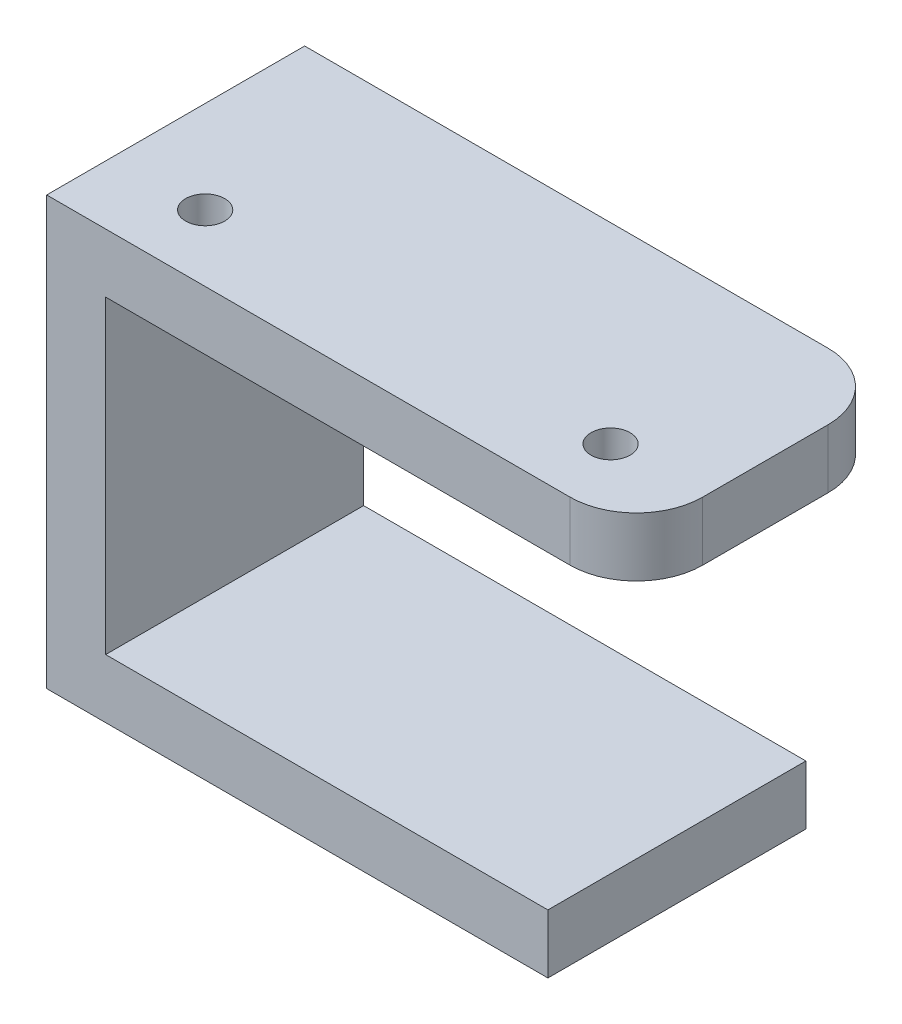
ISO-10303-21;
HEADER;
FILE_DESCRIPTION(('STEP AP214'),'2;1');
FILE_NAME('part.step','',(''),(''),'','','');
FILE_SCHEMA(('AUTOMOTIVE_DESIGN { 1 0 10303 214 1 1 1 1 }'));
ENDSEC;
DATA;
#1=APPLICATION_CONTEXT('core data for automotive mechanical design processes');
#2=APPLICATION_PROTOCOL_DEFINITION('international standard','automotive_design',2000,#1);
#3=PRODUCT_CONTEXT('',#1,'mechanical');
#4=PRODUCT('Part','Part','',(#3));
#5=PRODUCT_RELATED_PRODUCT_CATEGORY('part','',(#4));
#6=PRODUCT_DEFINITION_FORMATION('','',#4);
#7=PRODUCT_DEFINITION_CONTEXT('part definition',#1,'design');
#8=PRODUCT_DEFINITION('design','',#6,#7);
#9=PRODUCT_DEFINITION_SHAPE('','',#8);
#10=(LENGTH_UNIT() NAMED_UNIT(*) SI_UNIT(.MILLI.,.METRE.));
#11=(NAMED_UNIT(*) PLANE_ANGLE_UNIT() SI_UNIT($,.RADIAN.));
#12=(NAMED_UNIT(*) SI_UNIT($,.STERADIAN.) SOLID_ANGLE_UNIT());
#13=UNCERTAINTY_MEASURE_WITH_UNIT(LENGTH_MEASURE(1.E-05),#10,'distance_accuracy_value','');
#14=(GEOMETRIC_REPRESENTATION_CONTEXT(3) GLOBAL_UNCERTAINTY_ASSIGNED_CONTEXT((#13)) GLOBAL_UNIT_ASSIGNED_CONTEXT((#10,
#11,#12)) REPRESENTATION_CONTEXT('',''));
#15=CARTESIAN_POINT('',(0.,0.,0.));
#16=DIRECTION('',(0.,0.,1.));
#17=DIRECTION('',(1.,0.,0.));
#18=AXIS2_PLACEMENT_3D('',#15,#16,#17);
#19=CARTESIAN_POINT('',(8.,-50.,0.));
#20=DIRECTION('',(-1.,0.,0.));
#21=DIRECTION('',(0.,0.,1.));
#22=AXIS2_PLACEMENT_3D('',#19,#20,#21);
#23=PLANE('',#22);
#24=DIRECTION('',(0.,0.,1.));
#25=VECTOR('',#24,1.);
#26=CARTESIAN_POINT('',(8.,-42.,0.));
#27=LINE('',#26,#25);
#28=CARTESIAN_POINT('',(7.99999999999999,-42.,-35.));
#29=VERTEX_POINT('',#28);
#30=CARTESIAN_POINT('',(8.,-42.,0.));
#31=VERTEX_POINT('',#30);
#32=EDGE_CURVE('E198',#29,#31,#27,.T.);
#33=ORIENTED_EDGE('',*,*,#32,.F.);
#34=DIRECTION('',(0.,1.,0.));
#35=VECTOR('',#34,1.);
#36=CARTESIAN_POINT('',(7.99999999999999,-50.,-35.));
#37=LINE('',#36,#35);
#38=CARTESIAN_POINT('',(7.99999999999999,0.,-35.));
#39=VERTEX_POINT('',#38);
#40=EDGE_CURVE('E54',#29,#39,#37,.T.);
#41=ORIENTED_EDGE('',*,*,#40,.T.);
#42=DIRECTION('',(0.,0.,1.));
#43=VECTOR('',#42,1.);
#44=CARTESIAN_POINT('',(8.,0.,0.));
#45=LINE('',#44,#43);
#46=CARTESIAN_POINT('',(8.,0.,0.));
#47=VERTEX_POINT('',#46);
#48=EDGE_CURVE('E151',#39,#47,#45,.T.);
#49=ORIENTED_EDGE('',*,*,#48,.T.);
#50=DIRECTION('',(0.,1.,0.));
#51=VECTOR('',#50,1.);
#52=CARTESIAN_POINT('',(8.,-50.,0.));
#53=LINE('',#52,#51);
#54=EDGE_CURVE('E181',#31,#47,#53,.T.);
#55=ORIENTED_EDGE('',*,*,#54,.F.);
#56=EDGE_LOOP('',(#33,#41,#49,#55));
#57=FACE_BOUND('',#56,.T.);
#58=ADVANCED_FACE('F39',(#57),#23,.F.);
#59=CARTESIAN_POINT('',(71.,8.,-26.));
#60=DIRECTION('',(0.,-1.,0.));
#61=DIRECTION('',(0.,0.,-1.));
#62=AXIS2_PLACEMENT_3D('',#59,#60,#61);
#63=PLANE('',#62);
#64=DIRECTION('',(0.,0.,1.));
#65=VECTOR('',#64,1.);
#66=CARTESIAN_POINT('',(0.,8.,0.));
#67=LINE('',#66,#65);
#68=CARTESIAN_POINT('',(0.,8.,-35.));
#69=VERTEX_POINT('',#68);
#70=CARTESIAN_POINT('',(0.,8.,0.));
#71=VERTEX_POINT('',#70);
#72=EDGE_CURVE('E138',#69,#71,#67,.T.);
#73=ORIENTED_EDGE('',*,*,#72,.T.);
#74=DIRECTION('',(1.,0.,0.));
#75=VECTOR('',#74,1.);
#76=CARTESIAN_POINT('',(0.,8.,0.));
#77=LINE('',#76,#75);
#78=CARTESIAN_POINT('',(70.9999999999999,8.,0.));
#79=VERTEX_POINT('',#78);
#80=EDGE_CURVE('E93',#71,#79,#77,.T.);
#81=ORIENTED_EDGE('',*,*,#80,.T.);
#82=CARTESIAN_POINT('',(71.,8.,-9.));
#83=DIRECTION('',(0.,1.,0.));
#84=DIRECTION('',(0.,0.,1.));
#85=AXIS2_PLACEMENT_3D('',#82,#83,#84);
#86=CIRCLE('',#85,9.);
#87=CARTESIAN_POINT('',(80.,8.,-9.00000000000006));
#88=VERTEX_POINT('',#87);
#89=EDGE_CURVE('E110',#79,#88,#86,.T.);
#90=ORIENTED_EDGE('',*,*,#89,.T.);
#91=DIRECTION('',(0.,0.,-1.));
#92=VECTOR('',#91,1.);
#93=CARTESIAN_POINT('',(80.,8.,-9.00000000000006));
#94=LINE('',#93,#92);
#95=CARTESIAN_POINT('',(80.,8.,-25.9999999999999));
#96=VERTEX_POINT('',#95);
#97=EDGE_CURVE('E103',#88,#96,#94,.T.);
#98=ORIENTED_EDGE('',*,*,#97,.T.);
#99=CARTESIAN_POINT('',(71.,8.,-26.));
#100=DIRECTION('',(0.,1.,0.));
#101=DIRECTION('',(0.,0.,-1.));
#102=AXIS2_PLACEMENT_3D('',#99,#100,#101);
#103=CIRCLE('',#102,9.);
#104=CARTESIAN_POINT('',(70.9999999999999,8.,-35.));
#105=VERTEX_POINT('',#104);
#106=EDGE_CURVE('E108',#96,#105,#103,.T.);
#107=ORIENTED_EDGE('',*,*,#106,.T.);
#108=DIRECTION('',(-1.,0.,0.));
#109=VECTOR('',#108,1.);
#110=CARTESIAN_POINT('',(0.,8.,-35.));
#111=LINE('',#110,#109);
#112=EDGE_CURVE('E63',#105,#69,#111,.T.);
#113=ORIENTED_EDGE('',*,*,#112,.T.);
#114=EDGE_LOOP('',(#73,#81,#90,#98,#107,#113));
#115=FACE_BOUND('',#114,.T.);
#116=CARTESIAN_POINT('',(12.5,8.,-9.));
#117=DIRECTION('',(0.,1.,0.));
#118=DIRECTION('',(0.,0.,1.));
#119=AXIS2_PLACEMENT_3D('',#116,#117,#118);
#120=CIRCLE('',#119,2.65);
#121=CARTESIAN_POINT('',(12.5,8.,-6.35));
#122=VERTEX_POINT('',#121);
#123=EDGE_CURVE('E131',#122,#122,#120,.T.);
#124=ORIENTED_EDGE('',*,*,#123,.F.);
#125=EDGE_LOOP('',(#124));
#126=FACE_BOUND('',#125,.T.);
#127=CARTESIAN_POINT('',(67.5,8.,-9.));
#128=DIRECTION('',(0.,1.,0.));
#129=DIRECTION('',(0.,0.,1.));
#130=AXIS2_PLACEMENT_3D('',#127,#128,#129);
#131=CIRCLE('',#130,2.65);
#132=CARTESIAN_POINT('',(67.5,8.,-6.35));
#133=VERTEX_POINT('',#132);
#134=EDGE_CURVE('E172',#133,#133,#131,.T.);
#135=ORIENTED_EDGE('',*,*,#134,.F.);
#136=EDGE_LOOP('',(#135));
#137=FACE_BOUND('',#136,.T.);
#138=ADVANCED_FACE('F105',(#115,#126,#137),#63,.F.);
#139=CARTESIAN_POINT('',(71.,0.,-26.));
#140=DIRECTION('',(0.,-1.,0.));
#141=DIRECTION('',(0.,0.,-1.));
#142=AXIS2_PLACEMENT_3D('',#139,#140,#141);
#143=PLANE('',#142);
#144=ORIENTED_EDGE('',*,*,#48,.F.);
#145=DIRECTION('',(-1.,0.,0.));
#146=VECTOR('',#145,1.);
#147=CARTESIAN_POINT('',(0.,0.,-35.));
#148=LINE('',#147,#146);
#149=CARTESIAN_POINT('',(70.9999999999999,0.,-35.));
#150=VERTEX_POINT('',#149);
#151=EDGE_CURVE('E135',#150,#39,#148,.T.);
#152=ORIENTED_EDGE('',*,*,#151,.F.);
#153=CARTESIAN_POINT('',(71.,0.,-26.));
#154=DIRECTION('',(0.,1.,0.));
#155=DIRECTION('',(0.,0.,-1.));
#156=AXIS2_PLACEMENT_3D('',#153,#154,#155);
#157=CIRCLE('',#156,9.);
#158=CARTESIAN_POINT('',(80.,0.,-25.9999999999999));
#159=VERTEX_POINT('',#158);
#160=EDGE_CURVE('E85',#159,#150,#157,.T.);
#161=ORIENTED_EDGE('',*,*,#160,.F.);
#162=DIRECTION('',(0.,0.,-1.));
#163=VECTOR('',#162,1.);
#164=CARTESIAN_POINT('',(80.,0.,-9.00000000000006));
#165=LINE('',#164,#163);
#166=CARTESIAN_POINT('',(80.,0.,-9.00000000000006));
#167=VERTEX_POINT('',#166);
#168=EDGE_CURVE('E118',#167,#159,#165,.T.);
#169=ORIENTED_EDGE('',*,*,#168,.F.);
#170=CARTESIAN_POINT('',(71.,0.,-9.));
#171=DIRECTION('',(0.,1.,0.));
#172=DIRECTION('',(0.,0.,1.));
#173=AXIS2_PLACEMENT_3D('',#170,#171,#172);
#174=CIRCLE('',#173,9.);
#175=CARTESIAN_POINT('',(70.9999999999999,0.,0.));
#176=VERTEX_POINT('',#175);
#177=EDGE_CURVE('E130',#176,#167,#174,.T.);
#178=ORIENTED_EDGE('',*,*,#177,.F.);
#179=DIRECTION('',(1.,0.,0.));
#180=VECTOR('',#179,1.);
#181=CARTESIAN_POINT('',(0.,0.,0.));
#182=LINE('',#181,#180);
#183=EDGE_CURVE('E128',#47,#176,#182,.T.);
#184=ORIENTED_EDGE('',*,*,#183,.F.);
#185=EDGE_LOOP('',(#144,#152,#161,#169,#178,#184));
#186=FACE_BOUND('',#185,.T.);
#187=CARTESIAN_POINT('',(12.5,0.,-9.));
#188=DIRECTION('',(0.,1.,0.));
#189=DIRECTION('',(0.,0.,1.));
#190=AXIS2_PLACEMENT_3D('',#187,#188,#189);
#191=CIRCLE('',#190,2.65);
#192=CARTESIAN_POINT('',(12.5,0.,-6.35));
#193=VERTEX_POINT('',#192);
#194=EDGE_CURVE('E169',#193,#193,#191,.T.);
#195=ORIENTED_EDGE('',*,*,#194,.T.);
#196=EDGE_LOOP('',(#195));
#197=FACE_BOUND('',#196,.T.);
#198=CARTESIAN_POINT('',(67.5,0.,-9.));
#199=DIRECTION('',(0.,1.,0.));
#200=DIRECTION('',(0.,0.,1.));
#201=AXIS2_PLACEMENT_3D('',#198,#199,#200);
#202=CIRCLE('',#201,2.65);
#203=CARTESIAN_POINT('',(67.5,0.,-6.35));
#204=VERTEX_POINT('',#203);
#205=EDGE_CURVE('E175',#204,#204,#202,.T.);
#206=ORIENTED_EDGE('',*,*,#205,.T.);
#207=EDGE_LOOP('',(#206));
#208=FACE_BOUND('',#207,.T.);
#209=ADVANCED_FACE('F148',(#186,#197,#208),#143,.T.);
#210=CARTESIAN_POINT('',(0.,8.,0.));
#211=DIRECTION('',(1.,0.,0.));
#212=DIRECTION('',(0.,0.,-1.));
#213=AXIS2_PLACEMENT_3D('',#210,#211,#212);
#214=PLANE('',#213);
#215=DIRECTION('',(0.,-1.,0.));
#216=VECTOR('',#215,1.);
#217=CARTESIAN_POINT('',(0.,8.,-35.));
#218=LINE('',#217,#216);
#219=CARTESIAN_POINT('',(0.,-50.,-35.));
#220=VERTEX_POINT('',#219);
#221=EDGE_CURVE('E124',#69,#220,#218,.T.);
#222=ORIENTED_EDGE('',*,*,#221,.T.);
#223=DIRECTION('',(0.,0.,-1.));
#224=VECTOR('',#223,1.);
#225=CARTESIAN_POINT('',(0.,-50.,0.));
#226=LINE('',#225,#224);
#227=CARTESIAN_POINT('',(0.,-50.,0.));
#228=VERTEX_POINT('',#227);
#229=EDGE_CURVE('E186',#228,#220,#226,.T.);
#230=ORIENTED_EDGE('',*,*,#229,.F.);
#231=DIRECTION('',(0.,-1.,0.));
#232=VECTOR('',#231,1.);
#233=CARTESIAN_POINT('',(0.,8.,0.));
#234=LINE('',#233,#232);
#235=EDGE_CURVE('E11',#71,#228,#234,.T.);
#236=ORIENTED_EDGE('',*,*,#235,.F.);
#237=ORIENTED_EDGE('',*,*,#72,.F.);
#238=EDGE_LOOP('',(#222,#230,#236,#237));
#239=FACE_BOUND('',#238,.T.);
#240=ADVANCED_FACE('F41',(#239),#214,.F.);
#241=CARTESIAN_POINT('',(0.,8.,0.));
#242=DIRECTION('',(0.,0.,-1.));
#243=DIRECTION('',(-1.,0.,0.));
#244=AXIS2_PLACEMENT_3D('',#241,#242,#243);
#245=PLANE('',#244);
#246=ORIENTED_EDGE('',*,*,#235,.T.);
#247=DIRECTION('',(-1.,0.,0.));
#248=VECTOR('',#247,1.);
#249=CARTESIAN_POINT('',(0.,-50.,0.));
#250=LINE('',#249,#248);
#251=CARTESIAN_POINT('',(68.,-50.,0.));
#252=VERTEX_POINT('',#251);
#253=EDGE_CURVE('E184',#252,#228,#250,.T.);
#254=ORIENTED_EDGE('',*,*,#253,.F.);
#255=DIRECTION('',(0.,-1.,0.));
#256=VECTOR('',#255,1.);
#257=CARTESIAN_POINT('',(68.,-50.,0.));
#258=LINE('',#257,#256);
#259=CARTESIAN_POINT('',(68.,-42.,0.));
#260=VERTEX_POINT('',#259);
#261=EDGE_CURVE('E201',#260,#252,#258,.T.);
#262=ORIENTED_EDGE('',*,*,#261,.F.);
#263=DIRECTION('',(-1.,0.,0.));
#264=VECTOR('',#263,1.);
#265=CARTESIAN_POINT('',(68.,-42.,0.));
#266=LINE('',#265,#264);
#267=EDGE_CURVE('E194',#260,#31,#266,.T.);
#268=ORIENTED_EDGE('',*,*,#267,.T.);
#269=ORIENTED_EDGE('',*,*,#54,.T.);
#270=ORIENTED_EDGE('',*,*,#183,.T.);
#271=DIRECTION('',(0.,-1.,0.));
#272=VECTOR('',#271,1.);
#273=CARTESIAN_POINT('',(70.9999999999999,8.,0.));
#274=LINE('',#273,#272);
#275=EDGE_CURVE('E47',#79,#176,#274,.T.);
#276=ORIENTED_EDGE('',*,*,#275,.F.);
#277=ORIENTED_EDGE('',*,*,#80,.F.);
#278=EDGE_LOOP('',(#246,#254,#262,#268,#269,#270,#276,#277));
#279=FACE_BOUND('',#278,.T.);
#280=ADVANCED_FACE('F223',(#279),#245,.F.);
#281=CARTESIAN_POINT('',(71.,8.,-9.));
#282=DIRECTION('',(0.,-1.,0.));
#283=DIRECTION('',(0.,0.,-1.));
#284=AXIS2_PLACEMENT_3D('',#281,#282,#283);
#285=CYLINDRICAL_SURFACE('',#284,9.);
#286=ORIENTED_EDGE('',*,*,#177,.T.);
#287=DIRECTION('',(0.,-1.,0.));
#288=VECTOR('',#287,1.);
#289=CARTESIAN_POINT('',(80.,8.,-9.00000000000006));
#290=LINE('',#289,#288);
#291=EDGE_CURVE('E119',#88,#167,#290,.T.);
#292=ORIENTED_EDGE('',*,*,#291,.F.);
#293=ORIENTED_EDGE('',*,*,#89,.F.);
#294=ORIENTED_EDGE('',*,*,#275,.T.);
#295=EDGE_LOOP('',(#286,#292,#293,#294));
#296=FACE_BOUND('',#295,.T.);
#297=ADVANCED_FACE('F145',(#296),#285,.T.);
#298=CARTESIAN_POINT('',(80.,8.,-9.00000000000006));
#299=DIRECTION('',(-1.,0.,0.));
#300=DIRECTION('',(0.,0.,1.));
#301=AXIS2_PLACEMENT_3D('',#298,#299,#300);
#302=PLANE('',#301);
#303=ORIENTED_EDGE('',*,*,#168,.T.);
#304=DIRECTION('',(0.,-1.,0.));
#305=VECTOR('',#304,1.);
#306=CARTESIAN_POINT('',(80.,8.,-25.9999999999999));
#307=LINE('',#306,#305);
#308=EDGE_CURVE('E115',#96,#159,#307,.T.);
#309=ORIENTED_EDGE('',*,*,#308,.F.);
#310=ORIENTED_EDGE('',*,*,#97,.F.);
#311=ORIENTED_EDGE('',*,*,#291,.T.);
#312=EDGE_LOOP('',(#303,#309,#310,#311));
#313=FACE_BOUND('',#312,.T.);
#314=ADVANCED_FACE('F116',(#313),#302,.F.);
#315=CARTESIAN_POINT('',(71.,8.,-26.));
#316=DIRECTION('',(0.,-1.,0.));
#317=DIRECTION('',(0.,0.,-1.));
#318=AXIS2_PLACEMENT_3D('',#315,#316,#317);
#319=CYLINDRICAL_SURFACE('',#318,9.);
#320=ORIENTED_EDGE('',*,*,#160,.T.);
#321=DIRECTION('',(0.,-1.,0.));
#322=VECTOR('',#321,1.);
#323=CARTESIAN_POINT('',(70.9999999999999,8.,-35.));
#324=LINE('',#323,#322);
#325=EDGE_CURVE('E120',#105,#150,#324,.T.);
#326=ORIENTED_EDGE('',*,*,#325,.F.);
#327=ORIENTED_EDGE('',*,*,#106,.F.);
#328=ORIENTED_EDGE('',*,*,#308,.T.);
#329=EDGE_LOOP('',(#320,#326,#327,#328));
#330=FACE_BOUND('',#329,.T.);
#331=ADVANCED_FACE('F122',(#330),#319,.T.);
#332=CARTESIAN_POINT('',(0.,8.,-35.));
#333=DIRECTION('',(0.,0.,1.));
#334=DIRECTION('',(1.,0.,0.));
#335=AXIS2_PLACEMENT_3D('',#332,#333,#334);
#336=PLANE('',#335);
#337=ORIENTED_EDGE('',*,*,#151,.T.);
#338=ORIENTED_EDGE('',*,*,#40,.F.);
#339=DIRECTION('',(-1.,0.,0.));
#340=VECTOR('',#339,1.);
#341=CARTESIAN_POINT('',(68.,-42.,-35.));
#342=LINE('',#341,#340);
#343=CARTESIAN_POINT('',(68.,-42.,-35.));
#344=VERTEX_POINT('',#343);
#345=EDGE_CURVE('E187',#344,#29,#342,.T.);
#346=ORIENTED_EDGE('',*,*,#345,.F.);
#347=DIRECTION('',(0.,1.,0.));
#348=VECTOR('',#347,1.);
#349=CARTESIAN_POINT('',(68.,-50.,-35.));
#350=LINE('',#349,#348);
#351=CARTESIAN_POINT('',(68.,-50.,-35.));
#352=VERTEX_POINT('',#351);
#353=EDGE_CURVE('E204',#352,#344,#350,.T.);
#354=ORIENTED_EDGE('',*,*,#353,.F.);
#355=DIRECTION('',(1.,0.,0.));
#356=VECTOR('',#355,1.);
#357=CARTESIAN_POINT('',(0.,-50.,-35.));
#358=LINE('',#357,#356);
#359=EDGE_CURVE('E161',#220,#352,#358,.T.);
#360=ORIENTED_EDGE('',*,*,#359,.F.);
#361=ORIENTED_EDGE('',*,*,#221,.F.);
#362=ORIENTED_EDGE('',*,*,#112,.F.);
#363=ORIENTED_EDGE('',*,*,#325,.T.);
#364=EDGE_LOOP('',(#337,#338,#346,#354,#360,#361,#362,#363));
#365=FACE_BOUND('',#364,.T.);
#366=ADVANCED_FACE('F153',(#365),#336,.F.);
#367=CARTESIAN_POINT('',(12.5,8.,-9.));
#368=DIRECTION('',(0.,-1.,0.));
#369=DIRECTION('',(0.,0.,-1.));
#370=AXIS2_PLACEMENT_3D('',#367,#368,#369);
#371=CYLINDRICAL_SURFACE('',#370,2.65);
#372=ORIENTED_EDGE('',*,*,#123,.T.);
#373=EDGE_LOOP('',(#372));
#374=FACE_BOUND('',#373,.T.);
#375=ORIENTED_EDGE('',*,*,#194,.F.);
#376=EDGE_LOOP('',(#375));
#377=FACE_BOUND('',#376,.T.);
#378=ADVANCED_FACE('F245',(#374,#377),#371,.F.);
#379=CARTESIAN_POINT('',(67.5,8.,-9.));
#380=DIRECTION('',(0.,-1.,0.));
#381=DIRECTION('',(0.,0.,-1.));
#382=AXIS2_PLACEMENT_3D('',#379,#380,#381);
#383=CYLINDRICAL_SURFACE('',#382,2.65);
#384=ORIENTED_EDGE('',*,*,#134,.T.);
#385=EDGE_LOOP('',(#384));
#386=FACE_BOUND('',#385,.T.);
#387=ORIENTED_EDGE('',*,*,#205,.F.);
#388=EDGE_LOOP('',(#387));
#389=FACE_BOUND('',#388,.T.);
#390=ADVANCED_FACE('F236',(#386,#389),#383,.F.);
#391=CARTESIAN_POINT('',(0.,-50.,0.));
#392=DIRECTION('',(0.,-1.,0.));
#393=DIRECTION('',(0.,0.,-1.));
#394=AXIS2_PLACEMENT_3D('',#391,#392,#393);
#395=PLANE('',#394);
#396=ORIENTED_EDGE('',*,*,#229,.T.);
#397=ORIENTED_EDGE('',*,*,#359,.T.);
#398=DIRECTION('',(0.,0.,-1.));
#399=VECTOR('',#398,1.);
#400=CARTESIAN_POINT('',(68.,-50.,0.));
#401=LINE('',#400,#399);
#402=EDGE_CURVE('E207',#252,#352,#401,.T.);
#403=ORIENTED_EDGE('',*,*,#402,.F.);
#404=ORIENTED_EDGE('',*,*,#253,.T.);
#405=EDGE_LOOP('',(#396,#397,#403,#404));
#406=FACE_BOUND('',#405,.T.);
#407=ADVANCED_FACE('F233',(#406),#395,.T.);
#408=CARTESIAN_POINT('',(68.,-42.,0.));
#409=DIRECTION('',(0.,-1.,0.));
#410=DIRECTION('',(0.,0.,-1.));
#411=AXIS2_PLACEMENT_3D('',#408,#409,#410);
#412=PLANE('',#411);
#413=ORIENTED_EDGE('',*,*,#32,.T.);
#414=ORIENTED_EDGE('',*,*,#267,.F.);
#415=DIRECTION('',(0.,0.,1.));
#416=VECTOR('',#415,1.);
#417=CARTESIAN_POINT('',(68.,-42.,0.));
#418=LINE('',#417,#416);
#419=EDGE_CURVE('E197',#344,#260,#418,.T.);
#420=ORIENTED_EDGE('',*,*,#419,.F.);
#421=ORIENTED_EDGE('',*,*,#345,.T.);
#422=EDGE_LOOP('',(#413,#414,#420,#421));
#423=FACE_BOUND('',#422,.T.);
#424=ADVANCED_FACE('F235',(#423),#412,.F.);
#425=CARTESIAN_POINT('',(68.,0.,0.));
#426=DIRECTION('',(-1.,0.,0.));
#427=DIRECTION('',(0.,0.,1.));
#428=AXIS2_PLACEMENT_3D('',#425,#426,#427);
#429=PLANE('',#428);
#430=ORIENTED_EDGE('',*,*,#261,.T.);
#431=ORIENTED_EDGE('',*,*,#402,.T.);
#432=ORIENTED_EDGE('',*,*,#353,.T.);
#433=ORIENTED_EDGE('',*,*,#419,.T.);
#434=EDGE_LOOP('',(#430,#431,#432,#433));
#435=FACE_BOUND('',#434,.T.);
#436=ADVANCED_FACE('F214',(#435),#429,.F.);
#437=CLOSED_SHELL('',(#58,#138,#209,#240,#280,#297,#314,#331,#366,#378,#390,#407,#424,#436));
#438=MANIFOLD_SOLID_BREP('B2',#437);
#439=ADVANCED_BREP_SHAPE_REPRESENTATION('',(#18,#438),#14);
#440=SHAPE_DEFINITION_REPRESENTATION(#9,#439);
ENDSEC;
END-ISO-10303-21;
